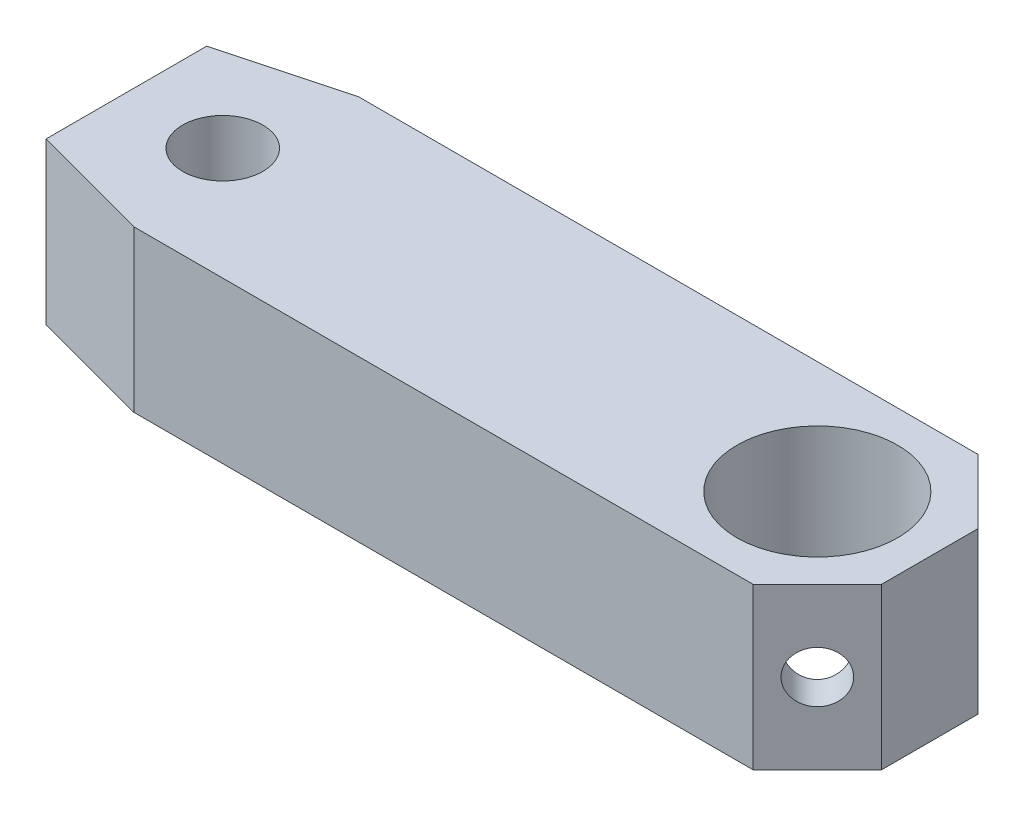
ISO-10303-21;
HEADER;
FILE_DESCRIPTION(('STEP AP214'),'2;1');
FILE_NAME('part.step','',(''),(''),'','','');
FILE_SCHEMA(('AUTOMOTIVE_DESIGN { 1 0 10303 214 1 1 1 1 }'));
ENDSEC;
DATA;
#1=APPLICATION_CONTEXT('core data for automotive mechanical design processes');
#2=APPLICATION_PROTOCOL_DEFINITION('international standard','automotive_design',2000,#1);
#3=PRODUCT_CONTEXT('',#1,'mechanical');
#4=PRODUCT('Part','Part','',(#3));
#5=PRODUCT_RELATED_PRODUCT_CATEGORY('part','',(#4));
#6=PRODUCT_DEFINITION_FORMATION('','',#4);
#7=PRODUCT_DEFINITION_CONTEXT('part definition',#1,'design');
#8=PRODUCT_DEFINITION('design','',#6,#7);
#9=PRODUCT_DEFINITION_SHAPE('','',#8);
#10=(LENGTH_UNIT() NAMED_UNIT(*) SI_UNIT(.MILLI.,.METRE.));
#11=(NAMED_UNIT(*) PLANE_ANGLE_UNIT() SI_UNIT($,.RADIAN.));
#12=(NAMED_UNIT(*) SI_UNIT($,.STERADIAN.) SOLID_ANGLE_UNIT());
#13=UNCERTAINTY_MEASURE_WITH_UNIT(LENGTH_MEASURE(1.E-05),#10,'distance_accuracy_value','');
#14=(GEOMETRIC_REPRESENTATION_CONTEXT(3) GLOBAL_UNCERTAINTY_ASSIGNED_CONTEXT((#13)) GLOBAL_UNIT_ASSIGNED_CONTEXT((#10,
#11,#12)) REPRESENTATION_CONTEXT('',''));
#15=CARTESIAN_POINT('',(0.,0.,0.));
#16=DIRECTION('',(0.,0.,1.));
#17=DIRECTION('',(1.,0.,0.));
#18=AXIS2_PLACEMENT_3D('',#15,#16,#17);
#19=CARTESIAN_POINT('',(0.,-5.,3.5));
#20=DIRECTION('',(0.,0.,1.));
#21=DIRECTION('',(1.,0.,0.));
#22=AXIS2_PLACEMENT_3D('',#19,#20,#21);
#23=PLANE('',#22);
#24=DIRECTION('',(1.,0.,0.));
#25=VECTOR('',#24,1.);
#26=CARTESIAN_POINT('',(0.,0.,3.5));
#27=LINE('',#26,#25);
#28=CARTESIAN_POINT('',(0.732050807568831,0.,3.5));
#29=VERTEX_POINT('',#28);
#30=CARTESIAN_POINT('',(20.,0.,3.5));
#31=VERTEX_POINT('',#30);
#32=EDGE_CURVE('E140',#29,#31,#27,.T.);
#33=ORIENTED_EDGE('',*,*,#32,.F.);
#34=DIRECTION('',(0.,1.,0.));
#35=VECTOR('',#34,1.);
#36=CARTESIAN_POINT('',(0.732050807568831,-5.,3.5));
#37=LINE('',#36,#35);
#38=CARTESIAN_POINT('',(0.732050807568831,-5.,3.5));
#39=VERTEX_POINT('',#38);
#40=EDGE_CURVE('E11',#39,#29,#37,.T.);
#41=ORIENTED_EDGE('',*,*,#40,.F.);
#42=DIRECTION('',(1.,0.,0.));
#43=VECTOR('',#42,1.);
#44=CARTESIAN_POINT('',(0.,-5.,3.5));
#45=LINE('',#44,#43);
#46=CARTESIAN_POINT('',(20.,-5.,3.5));
#47=VERTEX_POINT('',#46);
#48=EDGE_CURVE('E172',#39,#47,#45,.T.);
#49=ORIENTED_EDGE('',*,*,#48,.T.);
#50=DIRECTION('',(0.,1.,0.));
#51=VECTOR('',#50,1.);
#52=CARTESIAN_POINT('',(20.,-5.,3.5));
#53=LINE('',#52,#51);
#54=EDGE_CURVE('E43',#47,#31,#53,.T.);
#55=ORIENTED_EDGE('',*,*,#54,.T.);
#56=EDGE_LOOP('',(#33,#41,#49,#55));
#57=FACE_BOUND('',#56,.T.);
#58=ADVANCED_FACE('F39',(#57),#23,.T.);
#59=CARTESIAN_POINT('',(-0.825961894323354,-5.,3.08253175473055));
#60=DIRECTION('',(-0.258819045102524,0.,0.965925826289068));
#61=DIRECTION('',(0.965925826289068,0.,0.258819045102524));
#62=AXIS2_PLACEMENT_3D('',#59,#60,#61);
#63=PLANE('',#62);
#64=DIRECTION('',(0.965925826289068,0.,0.258819045102524));
#65=VECTOR('',#64,1.);
#66=CARTESIAN_POINT('',(-0.825961894323354,0.,3.08253175473055));
#67=LINE('',#66,#65);
#68=CARTESIAN_POINT('',(-3.,0.,2.5));
#69=VERTEX_POINT('',#68);
#70=EDGE_CURVE('E159',#69,#29,#67,.T.);
#71=ORIENTED_EDGE('',*,*,#70,.F.);
#72=DIRECTION('',(0.,1.,0.));
#73=VECTOR('',#72,1.);
#74=CARTESIAN_POINT('',(-3.,-5.,2.5));
#75=LINE('',#74,#73);
#76=CARTESIAN_POINT('',(-3.,-5.,2.5));
#77=VERTEX_POINT('',#76);
#78=EDGE_CURVE('E49',#77,#69,#75,.T.);
#79=ORIENTED_EDGE('',*,*,#78,.F.);
#80=DIRECTION('',(0.965925826289068,0.,0.258819045102524));
#81=VECTOR('',#80,1.);
#82=CARTESIAN_POINT('',(-0.825961894323354,-5.,3.08253175473055));
#83=LINE('',#82,#81);
#84=EDGE_CURVE('E126',#77,#39,#83,.T.);
#85=ORIENTED_EDGE('',*,*,#84,.T.);
#86=ORIENTED_EDGE('',*,*,#40,.T.);
#87=EDGE_LOOP('',(#71,#79,#85,#86));
#88=FACE_BOUND('',#87,.T.);
#89=ADVANCED_FACE('F176',(#88),#63,.T.);
#90=CARTESIAN_POINT('',(-3.,-5.,0.));
#91=DIRECTION('',(-1.,0.,0.));
#92=DIRECTION('',(0.,0.,1.));
#93=AXIS2_PLACEMENT_3D('',#90,#91,#92);
#94=PLANE('',#93);
#95=DIRECTION('',(0.,0.,1.));
#96=VECTOR('',#95,1.);
#97=CARTESIAN_POINT('',(-3.,0.,0.));
#98=LINE('',#97,#96);
#99=CARTESIAN_POINT('',(-3.,0.,-2.5));
#100=VERTEX_POINT('',#99);
#101=EDGE_CURVE('E114',#100,#69,#98,.T.);
#102=ORIENTED_EDGE('',*,*,#101,.F.);
#103=DIRECTION('',(0.,1.,0.));
#104=VECTOR('',#103,1.);
#105=CARTESIAN_POINT('',(-3.,-5.,-2.5));
#106=LINE('',#105,#104);
#107=CARTESIAN_POINT('',(-3.,-5.,-2.5));
#108=VERTEX_POINT('',#107);
#109=EDGE_CURVE('E109',#108,#100,#106,.T.);
#110=ORIENTED_EDGE('',*,*,#109,.F.);
#111=DIRECTION('',(0.,0.,1.));
#112=VECTOR('',#111,1.);
#113=CARTESIAN_POINT('',(-3.,-5.,0.));
#114=LINE('',#113,#112);
#115=EDGE_CURVE('E112',#108,#77,#114,.T.);
#116=ORIENTED_EDGE('',*,*,#115,.T.);
#117=ORIENTED_EDGE('',*,*,#78,.T.);
#118=EDGE_LOOP('',(#102,#110,#116,#117));
#119=FACE_BOUND('',#118,.T.);
#120=ADVANCED_FACE('F111',(#119),#94,.T.);
#121=CARTESIAN_POINT('',(-0.825961894323355,-5.,-3.08253175473055));
#122=DIRECTION('',(-0.258819045102524,0.,-0.965925826289068));
#123=DIRECTION('',(-0.965925826289068,0.,0.258819045102524));
#124=AXIS2_PLACEMENT_3D('',#121,#122,#123);
#125=PLANE('',#124);
#126=DIRECTION('',(-0.965925826289067,0.,0.258819045102524));
#127=VECTOR('',#126,1.);
#128=CARTESIAN_POINT('',(-0.825961894323355,0.,-3.08253175473055));
#129=LINE('',#128,#127);
#130=CARTESIAN_POINT('',(0.732050807568824,0.,-3.5));
#131=VERTEX_POINT('',#130);
#132=EDGE_CURVE('E156',#131,#100,#129,.T.);
#133=ORIENTED_EDGE('',*,*,#132,.F.);
#134=DIRECTION('',(0.,1.,0.));
#135=VECTOR('',#134,1.);
#136=CARTESIAN_POINT('',(0.732050807568824,-5.,-3.5));
#137=LINE('',#136,#135);
#138=CARTESIAN_POINT('',(0.732050807568824,-5.,-3.5));
#139=VERTEX_POINT('',#138);
#140=EDGE_CURVE('E119',#139,#131,#137,.T.);
#141=ORIENTED_EDGE('',*,*,#140,.F.);
#142=DIRECTION('',(-0.965925826289067,0.,0.258819045102524));
#143=VECTOR('',#142,1.);
#144=CARTESIAN_POINT('',(-0.825961894323355,-5.,-3.08253175473055));
#145=LINE('',#144,#143);
#146=EDGE_CURVE('E125',#139,#108,#145,.T.);
#147=ORIENTED_EDGE('',*,*,#146,.T.);
#148=ORIENTED_EDGE('',*,*,#109,.T.);
#149=EDGE_LOOP('',(#133,#141,#147,#148));
#150=FACE_BOUND('',#149,.T.);
#151=ADVANCED_FACE('F128',(#150),#125,.T.);
#152=CARTESIAN_POINT('',(0.,-5.,-3.5));
#153=DIRECTION('',(0.,0.,1.));
#154=DIRECTION('',(1.,0.,0.));
#155=AXIS2_PLACEMENT_3D('',#152,#153,#154);
#156=PLANE('',#155);
#157=DIRECTION('',(1.,0.,0.));
#158=VECTOR('',#157,1.);
#159=CARTESIAN_POINT('',(0.,0.,-3.5));
#160=LINE('',#159,#158);
#161=CARTESIAN_POINT('',(20.,0.,-3.5));
#162=VERTEX_POINT('',#161);
#163=EDGE_CURVE('E153',#131,#162,#160,.T.);
#164=ORIENTED_EDGE('',*,*,#163,.T.);
#165=DIRECTION('',(0.,1.,0.));
#166=VECTOR('',#165,1.);
#167=CARTESIAN_POINT('',(20.,-5.,-3.5));
#168=LINE('',#167,#166);
#169=CARTESIAN_POINT('',(20.,-5.,-3.5));
#170=VERTEX_POINT('',#169);
#171=EDGE_CURVE('E165',#170,#162,#168,.T.);
#172=ORIENTED_EDGE('',*,*,#171,.F.);
#173=DIRECTION('',(1.,0.,0.));
#174=VECTOR('',#173,1.);
#175=CARTESIAN_POINT('',(0.,-5.,-3.5));
#176=LINE('',#175,#174);
#177=EDGE_CURVE('E130',#139,#170,#176,.T.);
#178=ORIENTED_EDGE('',*,*,#177,.F.);
#179=ORIENTED_EDGE('',*,*,#140,.T.);
#180=EDGE_LOOP('',(#164,#172,#178,#179));
#181=FACE_BOUND('',#180,.T.);
#182=ADVANCED_FACE('F189',(#181),#156,.F.);
#183=CARTESIAN_POINT('',(11.75,-5.,-11.75));
#184=DIRECTION('',(-0.707106781186548,0.,0.707106781186547));
#185=DIRECTION('',(0.707106781186547,0.,0.707106781186548));
#186=AXIS2_PLACEMENT_3D('',#183,#184,#185);
#187=PLANE('',#186);
#188=CARTESIAN_POINT('',(21.,-2.5,-2.5));
#189=DIRECTION('',(0.707106781186549,0.,-0.707106781186546));
#190=DIRECTION('',(-0.707106781186546,0.,-0.707106781186549));
#191=AXIS2_PLACEMENT_3D('',#188,#189,#190);
#192=CIRCLE('',#191,0.799999999999998);
#193=CARTESIAN_POINT('',(20.4343145750508,-2.5,-3.06568542494924));
#194=VERTEX_POINT('',#193);
#195=EDGE_CURVE('E216',#194,#194,#192,.T.);
#196=ORIENTED_EDGE('',*,*,#195,.F.);
#197=EDGE_LOOP('',(#196));
#198=FACE_BOUND('',#197,.T.);
#199=DIRECTION('',(0.707106781186547,0.,0.707106781186548));
#200=VECTOR('',#199,1.);
#201=CARTESIAN_POINT('',(11.75,0.,-11.75));
#202=LINE('',#201,#200);
#203=CARTESIAN_POINT('',(22.,0.,-1.5));
#204=VERTEX_POINT('',#203);
#205=EDGE_CURVE('E150',#162,#204,#202,.T.);
#206=ORIENTED_EDGE('',*,*,#205,.T.);
#207=DIRECTION('',(0.,1.,0.));
#208=VECTOR('',#207,1.);
#209=CARTESIAN_POINT('',(22.,-5.,-1.5));
#210=LINE('',#209,#208);
#211=CARTESIAN_POINT('',(22.,-5.,-1.5));
#212=VERTEX_POINT('',#211);
#213=EDGE_CURVE('E168',#212,#204,#210,.T.);
#214=ORIENTED_EDGE('',*,*,#213,.F.);
#215=DIRECTION('',(0.707106781186547,0.,0.707106781186548));
#216=VECTOR('',#215,1.);
#217=CARTESIAN_POINT('',(11.75,-5.,-11.75));
#218=LINE('',#217,#216);
#219=EDGE_CURVE('E132',#170,#212,#218,.T.);
#220=ORIENTED_EDGE('',*,*,#219,.F.);
#221=ORIENTED_EDGE('',*,*,#171,.T.);
#222=EDGE_LOOP('',(#206,#214,#220,#221));
#223=FACE_BOUND('',#222,.T.);
#224=ADVANCED_FACE('F192',(#198,#223),#187,.F.);
#225=CARTESIAN_POINT('',(22.,-5.,0.));
#226=DIRECTION('',(-1.,0.,0.));
#227=DIRECTION('',(0.,0.,1.));
#228=AXIS2_PLACEMENT_3D('',#225,#226,#227);
#229=PLANE('',#228);
#230=DIRECTION('',(0.,0.,1.));
#231=VECTOR('',#230,1.);
#232=CARTESIAN_POINT('',(22.,0.,0.));
#233=LINE('',#232,#231);
#234=CARTESIAN_POINT('',(22.,0.,1.50000000000001));
#235=VERTEX_POINT('',#234);
#236=EDGE_CURVE('E147',#204,#235,#233,.T.);
#237=ORIENTED_EDGE('',*,*,#236,.T.);
#238=DIRECTION('',(0.,1.,0.));
#239=VECTOR('',#238,1.);
#240=CARTESIAN_POINT('',(22.,-5.,1.50000000000001));
#241=LINE('',#240,#239);
#242=CARTESIAN_POINT('',(22.,-5.,1.50000000000001));
#243=VERTEX_POINT('',#242);
#244=EDGE_CURVE('E170',#243,#235,#241,.T.);
#245=ORIENTED_EDGE('',*,*,#244,.F.);
#246=DIRECTION('',(0.,0.,1.));
#247=VECTOR('',#246,1.);
#248=CARTESIAN_POINT('',(22.,-5.,0.));
#249=LINE('',#248,#247);
#250=EDGE_CURVE('E271',#212,#243,#249,.T.);
#251=ORIENTED_EDGE('',*,*,#250,.F.);
#252=ORIENTED_EDGE('',*,*,#213,.T.);
#253=EDGE_LOOP('',(#237,#245,#251,#252));
#254=FACE_BOUND('',#253,.T.);
#255=ADVANCED_FACE('F196',(#254),#229,.F.);
#256=CARTESIAN_POINT('',(18.5,-5.,0.));
#257=DIRECTION('',(0.,1.,0.));
#258=DIRECTION('',(0.,0.,1.));
#259=AXIS2_PLACEMENT_3D('',#256,#257,#258);
#260=CYLINDRICAL_SURFACE('',#259,2.5);
#261=CARTESIAN_POINT('',(20.7404988473937,-2.5,1.10912799749519));
#262=CARTESIAN_POINT('',(20.7404988541167,-2.4563168810223,1.10912818541871));
#263=CARTESIAN_POINT('',(20.7388241767648,-2.41263224816393,1.1125304018607));
#264=CARTESIAN_POINT('',(20.732113868879,-2.32655020622629,1.12593179470893));
#265=CARTESIAN_POINT('',(20.7270774585958,-2.28415309817247,1.13593250161975));
#266=CARTESIAN_POINT('',(20.7136215489733,-2.20190594916675,1.16193440751882));
#267=CARTESIAN_POINT('',(20.7052082599999,-2.16205138734552,1.17792458777334));
#268=CARTESIAN_POINT('',(20.6849436904651,-2.08579117949244,1.21509982738939));
#269=CARTESIAN_POINT('',(20.6730917474474,-2.0493861998166,1.23628588761476));
#270=CARTESIAN_POINT('',(20.6454440363891,-1.97974680243317,1.2836842202225));
#271=CARTESIAN_POINT('',(20.6295320197195,-1.94665491726237,1.31003814826472));
#272=CARTESIAN_POINT('',(20.5939436171637,-1.88585678706832,1.36620054517443));
#273=CARTESIAN_POINT('',(20.5742666794856,-1.85815133268898,1.39600952016539));
#274=CARTESIAN_POINT('',(20.5306971684241,-1.80827730734993,1.45868354616379));
#275=CARTESIAN_POINT('',(20.5067153046472,-1.78625642534535,1.4916044987244));
#276=CARTESIAN_POINT('',(20.4551367795838,-1.74935071801721,1.55859681671745));
#277=CARTESIAN_POINT('',(20.4275410137925,-1.73446412911867,1.59266789561079));
#278=CARTESIAN_POINT('',(20.3702109889945,-1.71272811038582,1.65957469045755));
#279=CARTESIAN_POINT('',(20.34057444976,-1.7056348711692,1.69241479802918));
#280=CARTESIAN_POINT('',(20.2791781047094,-1.69891344724945,1.7568447522647));
#281=CARTESIAN_POINT('',(20.2474188061002,-1.6992834855991,1.78843489474068));
#282=CARTESIAN_POINT('',(20.183936611475,-1.70731975098619,1.84829473803465));
#283=CARTESIAN_POINT('',(20.1522539768443,-1.71472149892031,1.87664322380571));
#284=CARTESIAN_POINT('',(20.0888369923934,-1.73617591162058,1.93062999064361));
#285=CARTESIAN_POINT('',(20.0571026392871,-1.75022901682797,1.95626809209598));
#286=CARTESIAN_POINT('',(19.9942370738243,-1.78475161625891,2.00470732303012));
#287=CARTESIAN_POINT('',(19.9631184679375,-1.80529959079679,2.02746871397409));
#288=CARTESIAN_POINT('',(19.9029661086455,-1.85216510344927,2.06954961660544));
#289=CARTESIAN_POINT('',(19.8739329043215,-1.8784841537353,2.08886822378477));
#290=CARTESIAN_POINT('',(19.8177886514939,-1.93749382086661,2.12475695925679));
#291=CARTESIAN_POINT('',(19.7908165726072,-1.97041218152882,2.14117055718036));
#292=CARTESIAN_POINT('',(19.7414015320426,-2.04099413048974,2.17019482644184));
#293=CARTESIAN_POINT('',(19.7189591592858,-2.0786583347775,2.18280500339054));
#294=CARTESIAN_POINT('',(19.6794287718536,-2.15827837014686,2.20441911446709));
#295=CARTESIAN_POINT('',(19.66240956869,-2.20028103768846,2.21337707737416));
#296=CARTESIAN_POINT('',(19.6350682749203,-2.28701040319528,2.2275232326676));
#297=CARTESIAN_POINT('',(19.6247436385431,-2.33173605859247,2.23271285814559));
#298=CARTESIAN_POINT('',(19.6117173070573,-2.4206319550402,2.23922659867746));
#299=CARTESIAN_POINT('',(19.6087140765745,-2.4647468241569,2.24070369973722));
#300=CARTESIAN_POINT('',(19.6096337901048,-2.55288213526822,2.24024851592345));
#301=CARTESIAN_POINT('',(19.6135555993644,-2.59690259155014,2.23831678962858));
#302=CARTESIAN_POINT('',(19.6278531023916,-2.68218851367629,2.23114483636998));
#303=CARTESIAN_POINT('',(19.6380263436639,-2.7234970733505,2.22600831940711));
#304=CARTESIAN_POINT('',(19.6640915190041,-2.80370557986887,2.21248842478181));
#305=CARTESIAN_POINT('',(19.6799844152127,-2.84260512018495,2.20410450083366));
#306=CARTESIAN_POINT('',(19.7172718927272,-2.91817392358121,2.18373807606431));
#307=CARTESIAN_POINT('',(19.7388162112165,-2.95474227940474,2.17165585061502));
#308=CARTESIAN_POINT('',(19.7862014947658,-3.02348671109181,2.14393050396678));
#309=CARTESIAN_POINT('',(19.8120436293921,-3.05566158700413,2.12828641304743));
#310=CARTESIAN_POINT('',(19.8682106614373,-3.11615955531712,2.0926422503481));
#311=CARTESIAN_POINT('',(19.8986822651239,-3.14425240079187,2.07248148247199));
#312=CARTESIAN_POINT('',(19.9619856153365,-3.19404253863835,2.02832079001998));
#313=CARTESIAN_POINT('',(19.9948172610245,-3.21574010406074,2.00432102941991));
#314=CARTESIAN_POINT('',(20.0613480340638,-3.25191799863386,1.9529322867102));
#315=CARTESIAN_POINT('',(20.095039234485,-3.26644905920689,1.9255688928008));
#316=CARTESIAN_POINT('',(20.1622575220946,-3.28799205205537,1.86784880658013));
#317=CARTESIAN_POINT('',(20.1957846597637,-3.29500646366345,1.83749310487792));
#318=CARTESIAN_POINT('',(20.2600580359578,-3.30110785394987,1.77597545873001));
#319=CARTESIAN_POINT('',(20.2908617970982,-3.30052665751495,1.74490614639337));
#320=CARTESIAN_POINT('',(20.3503422443139,-3.29226145761088,1.68170050288552));
#321=CARTESIAN_POINT('',(20.3790190805558,-3.28457795609982,1.64956424727568));
#322=CARTESIAN_POINT('',(20.4331918914688,-3.26254086461702,1.58571746846321));
#323=CARTESIAN_POINT('',(20.4587259629554,-3.24827981377716,1.55400712571505));
#324=CARTESIAN_POINT('',(20.5066494650578,-3.21357669521386,1.49161230484143));
#325=CARTESIAN_POINT('',(20.5290383434733,-3.19313354408271,1.46092800757718));
#326=CARTESIAN_POINT('',(20.5711806033031,-3.14581944610727,1.40057618973544));
#327=CARTESIAN_POINT('',(20.5908141582918,-3.11874838189769,1.37098196334065));
#328=CARTESIAN_POINT('',(20.626412589917,-3.05929536207992,1.31509297148735));
#329=CARTESIAN_POINT('',(20.6423763395129,-3.02691178015333,1.28879922076634));
#330=CARTESIAN_POINT('',(20.6711562714463,-2.95638667718153,1.23972554536212));
#331=CARTESIAN_POINT('',(20.6838417540485,-2.91808249896281,1.21710204417814));
#332=CARTESIAN_POINT('',(20.7053683159992,-2.83760764716501,1.1776495007583));
#333=CARTESIAN_POINT('',(20.7142107619253,-2.79543835448412,1.16081839919842));
#334=CARTESIAN_POINT('',(20.7276249198159,-2.71150857944311,1.1348507413015));
#335=CARTESIAN_POINT('',(20.7324556973834,-2.66993242204363,1.12525198200641));
#336=CARTESIAN_POINT('',(20.7388922089384,-2.58557110057192,1.11239140019805));
#337=CARTESIAN_POINT('',(20.7404988408087,-2.54278627646441,1.10912781342986));
#338=CARTESIAN_POINT('',(20.7404988473937,-2.5,1.10912799749519));
#339=B_SPLINE_CURVE_WITH_KNOTS('',3,(#261,#262,#263,#264,#265,#266,#267,#268,#269,#270,#271,
#272,#273,#274,#275,#276,#277,#278,#279,#280,#281,#282,#283,#284,#285,#286,#287,#288,#289,#290,
#291,#292,#293,#294,#295,#296,#297,#298,#299,#300,#301,#302,#303,#304,#305,#306,#307,#308,#309,
#310,#311,#312,#313,#314,#315,#316,#317,#318,#319,#320,#321,#322,#323,#324,#325,#326,#327,#328,
#329,#330,#331,#332,#333,#334,#335,#336,#337,#338),.UNSPECIFIED.,.T.,.F.,(4,2,2,2,2,2,2,2,2,2,2,
2,2,2,2,2,2,2,2,2,2,2,2,2,2,2,2,2,2,2,2,2,2,2,2,2,2,2,4),(0.,0.130891168523662,
0.261812707628661,0.392494566159157,0.52320161726922,0.658181086047292,0.793180352769162,
0.93139688741782,1.06957923772488,1.20330337206031,1.33699566811544,1.46585063697655,
1.5947141395825,1.72519845034169,1.85571699231554,1.99192534158374,2.12815138832635,
2.26604280905129,2.40388176242564,2.53593995660066,2.66797651341177,2.79594728163428,
2.92393958672764,3.05574326637471,3.18758287266625,3.32519336185686,3.46279797482663,
3.59941398434423,3.73598491780592,3.86661026401423,3.99722637893302,4.12605842929881,
4.25491307046653,4.38828245677264,4.52169274783304,4.65980300496366,4.79786411004772,
4.92610371676324,5.05430760545675),.UNSPECIFIED.);
#340=CARTESIAN_POINT('',(20.7404988473937,-2.5,1.10912799749519));
#341=VERTEX_POINT('',#340);
#342=EDGE_CURVE('E213',#341,#341,#339,.T.);
#343=ORIENTED_EDGE('',*,*,#342,.T.);
#344=EDGE_LOOP('',(#343));
#345=FACE_BOUND('',#344,.T.);
#346=CARTESIAN_POINT('',(19.6091279974952,-2.5,-2.24049884739366));
#347=CARTESIAN_POINT('',(19.6091281854187,-2.4563168810223,-2.24049885411668));
#348=CARTESIAN_POINT('',(19.6125304018607,-2.41263224816393,-2.23882417676483));
#349=CARTESIAN_POINT('',(19.6259317947089,-2.32655020622629,-2.23211386887905));
#350=CARTESIAN_POINT('',(19.6359325016198,-2.28415309817247,-2.22707745859578));
#351=CARTESIAN_POINT('',(19.6619344075188,-2.20190594916675,-2.21362154897332));
#352=CARTESIAN_POINT('',(19.6779245877733,-2.16205138734552,-2.2052082599999));
#353=CARTESIAN_POINT('',(19.7150998273894,-2.08579117949244,-2.18494369046507));
#354=CARTESIAN_POINT('',(19.7362858876148,-2.0493861998166,-2.17309174744741));
#355=CARTESIAN_POINT('',(19.7836842202225,-1.97974680243317,-2.14544403638909));
#356=CARTESIAN_POINT('',(19.8100381482647,-1.94665491726237,-2.12953201971954));
#357=CARTESIAN_POINT('',(19.8662005451744,-1.88585678706832,-2.09394361716371));
#358=CARTESIAN_POINT('',(19.8960095201654,-1.85815133268898,-2.07426667948564));
#359=CARTESIAN_POINT('',(19.9586835461638,-1.80827730734993,-2.03069716842412));
#360=CARTESIAN_POINT('',(19.9916044987244,-1.78625642534535,-2.00671530464721));
#361=CARTESIAN_POINT('',(20.0585968167174,-1.7493507180172,-1.95513677958383));
#362=CARTESIAN_POINT('',(20.0926678956108,-1.73446412911867,-1.92754101379246));
#363=CARTESIAN_POINT('',(20.1595746904575,-1.71272811038582,-1.87021098899453));
#364=CARTESIAN_POINT('',(20.1924147980292,-1.7056348711692,-1.84057444976));
#365=CARTESIAN_POINT('',(20.2568447522647,-1.69891344724945,-1.77917810470935));
#366=CARTESIAN_POINT('',(20.2884348947407,-1.6992834855991,-1.74741880610021));
#367=CARTESIAN_POINT('',(20.3482947380346,-1.70731975098619,-1.68393661147495));
#368=CARTESIAN_POINT('',(20.3766432238057,-1.71472149892031,-1.65225397684429));
#369=CARTESIAN_POINT('',(20.4306299906436,-1.73617591162058,-1.58883699239339));
#370=CARTESIAN_POINT('',(20.456268092096,-1.75022901682797,-1.55710263928714));
#371=CARTESIAN_POINT('',(20.5047073230301,-1.78475161625891,-1.49423707382427));
#372=CARTESIAN_POINT('',(20.5274687139741,-1.80529959079679,-1.46311846793753));
#373=CARTESIAN_POINT('',(20.5695496166054,-1.85216510344927,-1.40296610864553));
#374=CARTESIAN_POINT('',(20.5888682237848,-1.8784841537353,-1.37393290432149));
#375=CARTESIAN_POINT('',(20.6247569592568,-1.93749382086661,-1.31778865149392));
#376=CARTESIAN_POINT('',(20.6411705571804,-1.97041218152882,-1.29081657260717));
#377=CARTESIAN_POINT('',(20.6701948264418,-2.04099413048974,-1.24140153204261));
#378=CARTESIAN_POINT('',(20.6828050033905,-2.0786583347775,-1.2189591592858));
#379=CARTESIAN_POINT('',(20.7044191144671,-2.15827837014686,-1.1794287718536));
#380=CARTESIAN_POINT('',(20.7133770773742,-2.20028103768846,-1.16240956869003));
#381=CARTESIAN_POINT('',(20.7275232326676,-2.28701040319529,-1.13506827492031));
#382=CARTESIAN_POINT('',(20.7327128581456,-2.33173605859247,-1.1247436385431));
#383=CARTESIAN_POINT('',(20.7392265986775,-2.4206319550402,-1.11171730705733));
#384=CARTESIAN_POINT('',(20.7407036997372,-2.4647468241569,-1.1087140765745));
#385=CARTESIAN_POINT('',(20.7402485159234,-2.55288213526822,-1.10963379010484));
#386=CARTESIAN_POINT('',(20.7383167896286,-2.59690259155014,-1.11355559936442));
#387=CARTESIAN_POINT('',(20.73114483637,-2.68218851367629,-1.12785310239162));
#388=CARTESIAN_POINT('',(20.7260083194071,-2.7234970733505,-1.13802634366389));
#389=CARTESIAN_POINT('',(20.7124884247818,-2.80370557986887,-1.1640915190041));
#390=CARTESIAN_POINT('',(20.7041045008337,-2.84260512018495,-1.17998441521267));
#391=CARTESIAN_POINT('',(20.6837380760643,-2.91817392358121,-1.21727189272725));
#392=CARTESIAN_POINT('',(20.671655850615,-2.95474227940474,-1.23881621121647));
#393=CARTESIAN_POINT('',(20.6439305039668,-3.02348671109181,-1.28620149476584));
#394=CARTESIAN_POINT('',(20.6282864130474,-3.05566158700413,-1.31204362939209));
#395=CARTESIAN_POINT('',(20.5926422503481,-3.11615955531712,-1.36821066143728));
#396=CARTESIAN_POINT('',(20.572481482472,-3.14425240079187,-1.3986822651239));
#397=CARTESIAN_POINT('',(20.52832079002,-3.19404253863835,-1.46198561533654));
#398=CARTESIAN_POINT('',(20.5043210294199,-3.21574010406074,-1.49481726102455));
#399=CARTESIAN_POINT('',(20.4529322867102,-3.25191799863386,-1.56134803406382));
#400=CARTESIAN_POINT('',(20.4255688928008,-3.26644905920689,-1.59503923448506));
#401=CARTESIAN_POINT('',(20.3678488065801,-3.28799205205537,-1.66225752209456));
#402=CARTESIAN_POINT('',(20.3374931048779,-3.29500646366345,-1.69578465976372));
#403=CARTESIAN_POINT('',(20.27597545873,-3.30110785394987,-1.76005803595779));
#404=CARTESIAN_POINT('',(20.2449061463934,-3.30052665751495,-1.79086179709819));
#405=CARTESIAN_POINT('',(20.1817005028855,-3.29226145761088,-1.85034224431393));
#406=CARTESIAN_POINT('',(20.1495642472757,-3.28457795609982,-1.87901908055577));
#407=CARTESIAN_POINT('',(20.0857174684632,-3.26254086461702,-1.93319189146879));
#408=CARTESIAN_POINT('',(20.0540071257151,-3.24827981377717,-1.9587259629554));
#409=CARTESIAN_POINT('',(19.9916123048414,-3.21357669521387,-2.00664946505784));
#410=CARTESIAN_POINT('',(19.9609280075772,-3.19313354408271,-2.02903834347329));
#411=CARTESIAN_POINT('',(19.9005761897354,-3.14581944610727,-2.07118060330313));
#412=CARTESIAN_POINT('',(19.8709819633406,-3.11874838189769,-2.09081415829184));
#413=CARTESIAN_POINT('',(19.8150929714873,-3.05929536207991,-2.126412589917));
#414=CARTESIAN_POINT('',(19.7887992207663,-3.02691178015333,-2.14237633951295));
#415=CARTESIAN_POINT('',(19.7397255453621,-2.95638667718153,-2.17115627144635));
#416=CARTESIAN_POINT('',(19.7171020441781,-2.91808249896281,-2.18384175404855));
#417=CARTESIAN_POINT('',(19.6776495007583,-2.83760764716501,-2.20536831599921));
#418=CARTESIAN_POINT('',(19.6608183991984,-2.79543835448411,-2.21421076192526));
#419=CARTESIAN_POINT('',(19.6348507413015,-2.71150857944311,-2.22762491981589));
#420=CARTESIAN_POINT('',(19.6252519820064,-2.66993242204363,-2.23245569738337));
#421=CARTESIAN_POINT('',(19.612391400198,-2.58557110057192,-2.23889220893843));
#422=CARTESIAN_POINT('',(19.6091278134299,-2.54278627646441,-2.24049884080867));
#423=CARTESIAN_POINT('',(19.6091279974952,-2.5,-2.24049884739366));
#424=B_SPLINE_CURVE_WITH_KNOTS('',3,(#346,#347,#348,#349,#350,#351,#352,#353,#354,#355,#356,
#357,#358,#359,#360,#361,#362,#363,#364,#365,#366,#367,#368,#369,#370,#371,#372,#373,#374,#375,
#376,#377,#378,#379,#380,#381,#382,#383,#384,#385,#386,#387,#388,#389,#390,#391,#392,#393,#394,
#395,#396,#397,#398,#399,#400,#401,#402,#403,#404,#405,#406,#407,#408,#409,#410,#411,#412,#413,
#414,#415,#416,#417,#418,#419,#420,#421,#422,#423),.UNSPECIFIED.,.T.,.F.,(4,2,2,2,2,2,2,2,2,2,2,
2,2,2,2,2,2,2,2,2,2,2,2,2,2,2,2,2,2,2,2,2,2,2,2,2,2,2,4),(0.,0.130891168523663,
0.261812707628661,0.392494566159157,0.52320161726922,0.658181086047293,0.793180352769163,
0.931396887417821,1.06957923772489,1.20330337206031,1.33699566811544,1.46585063697655,
1.5947141395825,1.72519845034169,1.85571699231554,1.99192534158374,2.12815138832635,
2.26604280905129,2.40388176242564,2.53593995660066,2.66797651341177,2.79594728163428,
2.92393958672764,3.05574326637471,3.18758287266625,3.32519336185686,3.46279797482663,
3.59941398434423,3.73598491780592,3.86661026401423,3.99722637893302,4.12605842929881,
4.25491307046653,4.38828245677264,4.52169274783305,4.65980300496366,4.79786411004772,
4.92610371676324,5.05430760545675),.UNSPECIFIED.);
#425=CARTESIAN_POINT('',(19.6091279974952,-2.5,-2.24049884739366));
#426=VERTEX_POINT('',#425);
#427=EDGE_CURVE('E242',#426,#426,#424,.T.);
#428=ORIENTED_EDGE('',*,*,#427,.T.);
#429=EDGE_LOOP('',(#428));
#430=FACE_BOUND('',#429,.T.);
#431=CARTESIAN_POINT('',(18.5,-5.,0.));
#432=DIRECTION('',(0.,1.,0.));
#433=DIRECTION('',(0.,0.,1.));
#434=AXIS2_PLACEMENT_3D('',#431,#432,#433);
#435=CIRCLE('',#434,2.5);
#436=CARTESIAN_POINT('',(18.5,-5.,2.5));
#437=VERTEX_POINT('',#436);
#438=EDGE_CURVE('E161',#437,#437,#435,.T.);
#439=ORIENTED_EDGE('',*,*,#438,.F.);
#440=EDGE_LOOP('',(#439));
#441=FACE_BOUND('',#440,.T.);
#442=CARTESIAN_POINT('',(18.5,0.,0.));
#443=DIRECTION('',(0.,1.,0.));
#444=DIRECTION('',(0.,0.,1.));
#445=AXIS2_PLACEMENT_3D('',#442,#443,#444);
#446=CIRCLE('',#445,2.5);
#447=CARTESIAN_POINT('',(18.5,0.,2.5));
#448=VERTEX_POINT('',#447);
#449=EDGE_CURVE('E137',#448,#448,#446,.T.);
#450=ORIENTED_EDGE('',*,*,#449,.T.);
#451=EDGE_LOOP('',(#450));
#452=FACE_BOUND('',#451,.T.);
#453=ADVANCED_FACE('F41',(#345,#430,#441,#452),#260,.F.);
#454=CARTESIAN_POINT('',(11.75,-5.,11.75));
#455=DIRECTION('',(0.707106781186546,0.,0.707106781186549));
#456=DIRECTION('',(0.707106781186549,0.,-0.707106781186546));
#457=AXIS2_PLACEMENT_3D('',#454,#455,#456);
#458=PLANE('',#457);
#459=CARTESIAN_POINT('',(21.,-2.5,2.5));
#460=DIRECTION('',(0.707106781186549,0.,0.707106781186546));
#461=DIRECTION('',(0.707106781186546,0.,-0.707106781186549));
#462=AXIS2_PLACEMENT_3D('',#459,#460,#461);
#463=CIRCLE('',#462,0.799999999999998);
#464=CARTESIAN_POINT('',(21.5656854249492,-2.5,1.93431457505076));
#465=VERTEX_POINT('',#464);
#466=EDGE_CURVE('E211',#465,#465,#463,.T.);
#467=ORIENTED_EDGE('',*,*,#466,.F.);
#468=EDGE_LOOP('',(#467));
#469=FACE_BOUND('',#468,.T.);
#470=DIRECTION('',(0.707106781186549,0.,-0.707106781186546));
#471=VECTOR('',#470,1.);
#472=CARTESIAN_POINT('',(11.75,0.,11.75));
#473=LINE('',#472,#471);
#474=EDGE_CURVE('E144',#31,#235,#473,.T.);
#475=ORIENTED_EDGE('',*,*,#474,.F.);
#476=ORIENTED_EDGE('',*,*,#54,.F.);
#477=DIRECTION('',(0.707106781186549,0.,-0.707106781186546));
#478=VECTOR('',#477,1.);
#479=CARTESIAN_POINT('',(11.75,-5.,11.75));
#480=LINE('',#479,#478);
#481=EDGE_CURVE('E269',#47,#243,#480,.T.);
#482=ORIENTED_EDGE('',*,*,#481,.T.);
#483=ORIENTED_EDGE('',*,*,#244,.T.);
#484=EDGE_LOOP('',(#475,#476,#482,#483));
#485=FACE_BOUND('',#484,.T.);
#486=ADVANCED_FACE('F173',(#469,#485),#458,.T.);
#487=CARTESIAN_POINT('',(0.,-5.,0.));
#488=DIRECTION('',(0.,1.,0.));
#489=DIRECTION('',(0.,0.,1.));
#490=AXIS2_PLACEMENT_3D('',#487,#488,#489);
#491=PLANE('',#490);
#492=CARTESIAN_POINT('',(0.,-5.,0.));
#493=DIRECTION('',(0.,1.,0.));
#494=DIRECTION('',(0.,0.,1.));
#495=AXIS2_PLACEMENT_3D('',#492,#493,#494);
#496=CIRCLE('',#495,1.25);
#497=CARTESIAN_POINT('',(0.,-5.,1.25));
#498=VERTEX_POINT('',#497);
#499=EDGE_CURVE('E141',#498,#498,#496,.T.);
#500=ORIENTED_EDGE('',*,*,#499,.T.);
#501=EDGE_LOOP('',(#500));
#502=FACE_BOUND('',#501,.T.);
#503=ORIENTED_EDGE('',*,*,#438,.T.);
#504=EDGE_LOOP('',(#503));
#505=FACE_BOUND('',#504,.T.);
#506=ORIENTED_EDGE('',*,*,#48,.F.);
#507=ORIENTED_EDGE('',*,*,#84,.F.);
#508=ORIENTED_EDGE('',*,*,#115,.F.);
#509=ORIENTED_EDGE('',*,*,#146,.F.);
#510=ORIENTED_EDGE('',*,*,#177,.T.);
#511=ORIENTED_EDGE('',*,*,#219,.T.);
#512=ORIENTED_EDGE('',*,*,#250,.T.);
#513=ORIENTED_EDGE('',*,*,#481,.F.);
#514=EDGE_LOOP('',(#506,#507,#508,#509,#510,#511,#512,#513));
#515=FACE_BOUND('',#514,.T.);
#516=ADVANCED_FACE('F123',(#502,#505,#515),#491,.F.);
#517=CARTESIAN_POINT('',(0.,0.,0.));
#518=DIRECTION('',(0.,1.,0.));
#519=DIRECTION('',(0.,0.,1.));
#520=AXIS2_PLACEMENT_3D('',#517,#518,#519);
#521=PLANE('',#520);
#522=CARTESIAN_POINT('',(0.,0.,0.));
#523=DIRECTION('',(0.,1.,0.));
#524=DIRECTION('',(0.,0.,1.));
#525=AXIS2_PLACEMENT_3D('',#522,#523,#524);
#526=CIRCLE('',#525,1.25);
#527=CARTESIAN_POINT('',(0.,0.,1.25));
#528=VERTEX_POINT('',#527);
#529=EDGE_CURVE('E257',#528,#528,#526,.T.);
#530=ORIENTED_EDGE('',*,*,#529,.F.);
#531=EDGE_LOOP('',(#530));
#532=FACE_BOUND('',#531,.T.);
#533=ORIENTED_EDGE('',*,*,#449,.F.);
#534=EDGE_LOOP('',(#533));
#535=FACE_BOUND('',#534,.T.);
#536=ORIENTED_EDGE('',*,*,#32,.T.);
#537=ORIENTED_EDGE('',*,*,#474,.T.);
#538=ORIENTED_EDGE('',*,*,#236,.F.);
#539=ORIENTED_EDGE('',*,*,#205,.F.);
#540=ORIENTED_EDGE('',*,*,#163,.F.);
#541=ORIENTED_EDGE('',*,*,#132,.T.);
#542=ORIENTED_EDGE('',*,*,#101,.T.);
#543=ORIENTED_EDGE('',*,*,#70,.T.);
#544=EDGE_LOOP('',(#536,#537,#538,#539,#540,#541,#542,#543));
#545=FACE_BOUND('',#544,.T.);
#546=ADVANCED_FACE('F175',(#532,#535,#545),#521,.T.);
#547=CARTESIAN_POINT('',(0.,0.,0.));
#548=DIRECTION('',(0.,1.,0.));
#549=DIRECTION('',(0.,0.,1.));
#550=AXIS2_PLACEMENT_3D('',#547,#548,#549);
#551=CYLINDRICAL_SURFACE('',#550,1.25);
#552=ORIENTED_EDGE('',*,*,#499,.F.);
#553=EDGE_LOOP('',(#552));
#554=FACE_BOUND('',#553,.T.);
#555=ORIENTED_EDGE('',*,*,#529,.T.);
#556=EDGE_LOOP('',(#555));
#557=FACE_BOUND('',#556,.T.);
#558=ADVANCED_FACE('F235',(#554,#557),#551,.F.);
#559=CARTESIAN_POINT('',(21.,-2.5,-2.5));
#560=DIRECTION('',(0.707106781186549,0.,-0.707106781186546));
#561=DIRECTION('',(-0.707106781186546,0.,-0.707106781186549));
#562=AXIS2_PLACEMENT_3D('',#559,#560,#561);
#563=CYLINDRICAL_SURFACE('',#562,0.799999999999999);
#564=ORIENTED_EDGE('',*,*,#427,.F.);
#565=EDGE_LOOP('',(#564));
#566=FACE_BOUND('',#565,.T.);
#567=ORIENTED_EDGE('',*,*,#195,.T.);
#568=EDGE_LOOP('',(#567));
#569=FACE_BOUND('',#568,.T.);
#570=ADVANCED_FACE('F230',(#566,#569),#563,.F.);
#571=CARTESIAN_POINT('',(21.,-2.5,2.5));
#572=DIRECTION('',(0.707106781186549,0.,0.707106781186546));
#573=DIRECTION('',(0.707106781186546,0.,-0.707106781186549));
#574=AXIS2_PLACEMENT_3D('',#571,#572,#573);
#575=CYLINDRICAL_SURFACE('',#574,0.799999999999999);
#576=ORIENTED_EDGE('',*,*,#342,.F.);
#577=EDGE_LOOP('',(#576));
#578=FACE_BOUND('',#577,.T.);
#579=ORIENTED_EDGE('',*,*,#466,.T.);
#580=EDGE_LOOP('',(#579));
#581=FACE_BOUND('',#580,.T.);
#582=ADVANCED_FACE('F227',(#578,#581),#575,.F.);
#583=CLOSED_SHELL('',(#58,#89,#120,#151,#182,#224,#255,#453,#486,#516,#546,#558,#570,#582));
#584=MANIFOLD_SOLID_BREP('B2',#583);
#585=ADVANCED_BREP_SHAPE_REPRESENTATION('',(#18,#584),#14);
#586=SHAPE_DEFINITION_REPRESENTATION(#9,#585);
ENDSEC;
END-ISO-10303-21;
